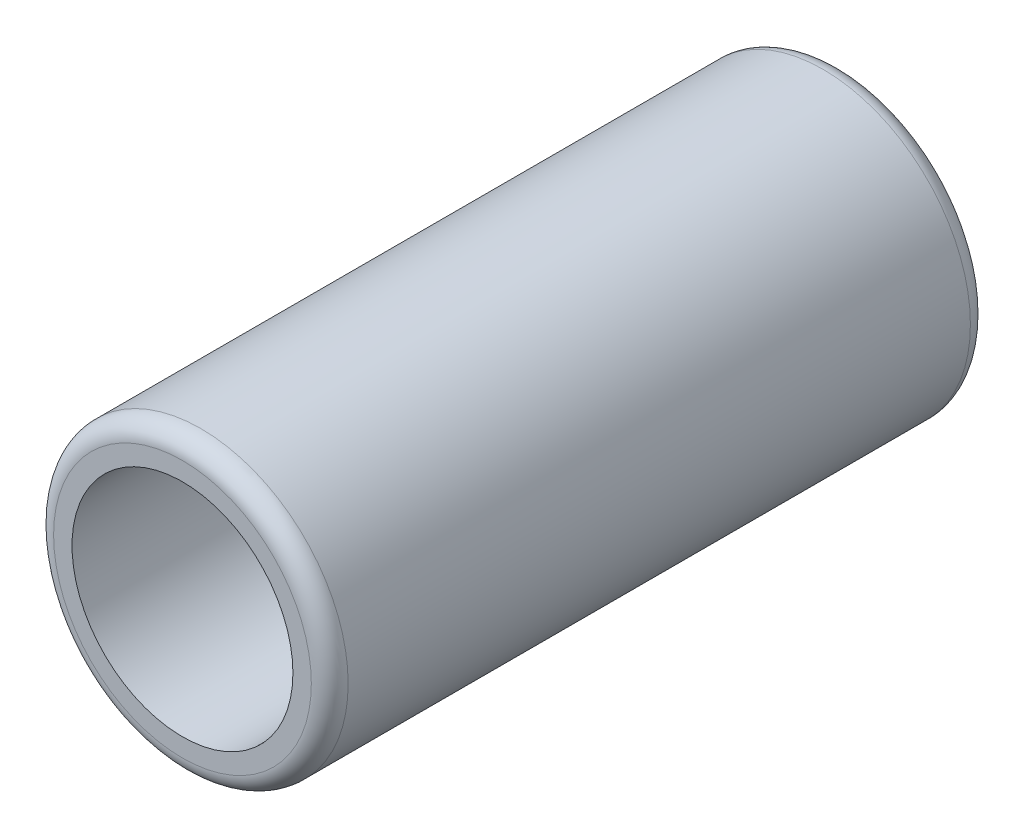
ISO-10303-21;
HEADER;
FILE_DESCRIPTION(('STEP AP214'),'2;1');
FILE_NAME('part.step','',(''),(''),'','','');
FILE_SCHEMA(('AUTOMOTIVE_DESIGN { 1 0 10303 214 1 1 1 1 }'));
ENDSEC;
DATA;
#1=APPLICATION_CONTEXT('core data for automotive mechanical design processes');
#2=APPLICATION_PROTOCOL_DEFINITION('international standard','automotive_design',2000,#1);
#3=PRODUCT_CONTEXT('',#1,'mechanical');
#4=PRODUCT('Part','Part','',(#3));
#5=PRODUCT_RELATED_PRODUCT_CATEGORY('part','',(#4));
#6=PRODUCT_DEFINITION_FORMATION('','',#4);
#7=PRODUCT_DEFINITION_CONTEXT('part definition',#1,'design');
#8=PRODUCT_DEFINITION('design','',#6,#7);
#9=PRODUCT_DEFINITION_SHAPE('','',#8);
#10=(LENGTH_UNIT() NAMED_UNIT(*) SI_UNIT(.MILLI.,.METRE.));
#11=(NAMED_UNIT(*) PLANE_ANGLE_UNIT() SI_UNIT($,.RADIAN.));
#12=(NAMED_UNIT(*) SI_UNIT($,.STERADIAN.) SOLID_ANGLE_UNIT());
#13=UNCERTAINTY_MEASURE_WITH_UNIT(LENGTH_MEASURE(1.E-05),#10,'distance_accuracy_value','');
#14=(GEOMETRIC_REPRESENTATION_CONTEXT(3) GLOBAL_UNCERTAINTY_ASSIGNED_CONTEXT((#13)) GLOBAL_UNIT_ASSIGNED_CONTEXT((#10,
#11,#12)) REPRESENTATION_CONTEXT('',''));
#15=CARTESIAN_POINT('',(0.,0.,0.));
#16=DIRECTION('',(0.,0.,1.));
#17=DIRECTION('',(1.,0.,0.));
#18=AXIS2_PLACEMENT_3D('',#15,#16,#17);
#19=CARTESIAN_POINT('',(0.,0.,17.9));
#20=DIRECTION('',(0.,0.,1.));
#21=DIRECTION('',(1.,0.,0.));
#22=AXIS2_PLACEMENT_3D('',#19,#20,#21);
#23=PLANE('',#22);
#24=CARTESIAN_POINT('',(0.,0.,17.9));
#25=DIRECTION('',(0.,0.,1.));
#26=DIRECTION('',(1.,0.,0.));
#27=AXIS2_PLACEMENT_3D('',#24,#25,#26);
#28=CIRCLE('',#27,3.5);
#29=CARTESIAN_POINT('',(3.5,0.,17.9));
#30=VERTEX_POINT('',#29);
#31=EDGE_CURVE('E10',#30,#30,#28,.T.);
#32=ORIENTED_EDGE('',*,*,#31,.T.);
#33=EDGE_LOOP('',(#32));
#34=FACE_BOUND('',#33,.T.);
#35=CARTESIAN_POINT('',(0.,0.,17.9));
#36=DIRECTION('',(0.,0.,1.));
#37=DIRECTION('',(1.,0.,0.));
#38=AXIS2_PLACEMENT_3D('',#35,#36,#37);
#39=CIRCLE('',#38,3.);
#40=CARTESIAN_POINT('',(3.,0.,17.9));
#41=VERTEX_POINT('',#40);
#42=EDGE_CURVE('E52',#41,#41,#39,.T.);
#43=ORIENTED_EDGE('',*,*,#42,.F.);
#44=EDGE_LOOP('',(#43));
#45=FACE_BOUND('',#44,.T.);
#46=ADVANCED_FACE('F32',(#34,#45),#23,.T.);
#47=CARTESIAN_POINT('',(0.,0.,0.));
#48=DIRECTION('',(0.,0.,1.));
#49=DIRECTION('',(1.,0.,0.));
#50=AXIS2_PLACEMENT_3D('',#47,#48,#49);
#51=PLANE('',#50);
#52=CARTESIAN_POINT('',(0.,0.,0.));
#53=DIRECTION('',(0.,0.,1.));
#54=DIRECTION('',(1.,0.,0.));
#55=AXIS2_PLACEMENT_3D('',#52,#53,#54);
#56=CIRCLE('',#55,3.5);
#57=CARTESIAN_POINT('',(3.5,0.,0.));
#58=VERTEX_POINT('',#57);
#59=EDGE_CURVE('E39',#58,#58,#56,.F.);
#60=ORIENTED_EDGE('',*,*,#59,.T.);
#61=EDGE_LOOP('',(#60));
#62=FACE_BOUND('',#61,.T.);
#63=CARTESIAN_POINT('',(0.,0.,0.));
#64=DIRECTION('',(0.,0.,1.));
#65=DIRECTION('',(1.,0.,0.));
#66=AXIS2_PLACEMENT_3D('',#63,#64,#65);
#67=CIRCLE('',#66,3.);
#68=CARTESIAN_POINT('',(3.,0.,0.));
#69=VERTEX_POINT('',#68);
#70=EDGE_CURVE('E53',#69,#69,#67,.T.);
#71=ORIENTED_EDGE('',*,*,#70,.T.);
#72=EDGE_LOOP('',(#71));
#73=FACE_BOUND('',#72,.T.);
#74=ADVANCED_FACE('F63',(#62,#73),#51,.F.);
#75=CARTESIAN_POINT('',(0.,0.,17.9));
#76=DIRECTION('',(0.,0.,-1.));
#77=DIRECTION('',(-1.,0.,0.));
#78=AXIS2_PLACEMENT_3D('',#75,#76,#77);
#79=CYLINDRICAL_SURFACE('',#78,4.);
#80=CARTESIAN_POINT('',(0.,0.,0.5));
#81=DIRECTION('',(0.,0.,1.));
#82=DIRECTION('',(1.,0.,0.));
#83=AXIS2_PLACEMENT_3D('',#80,#81,#82);
#84=CIRCLE('',#83,4.);
#85=CARTESIAN_POINT('',(4.,0.,0.5));
#86=VERTEX_POINT('',#85);
#87=EDGE_CURVE('E43',#86,#86,#84,.T.);
#88=ORIENTED_EDGE('',*,*,#87,.T.);
#89=EDGE_LOOP('',(#88));
#90=FACE_BOUND('',#89,.T.);
#91=CARTESIAN_POINT('',(0.,0.,17.4));
#92=DIRECTION('',(0.,0.,1.));
#93=DIRECTION('',(1.,0.,0.));
#94=AXIS2_PLACEMENT_3D('',#91,#92,#93);
#95=CIRCLE('',#94,4.);
#96=CARTESIAN_POINT('',(4.,0.,17.4));
#97=VERTEX_POINT('',#96);
#98=EDGE_CURVE('E47',#97,#97,#95,.F.);
#99=ORIENTED_EDGE('',*,*,#98,.T.);
#100=EDGE_LOOP('',(#99));
#101=FACE_BOUND('',#100,.T.);
#102=ADVANCED_FACE('F68',(#90,#101),#79,.T.);
#103=CARTESIAN_POINT('',(0.,0.,17.9));
#104=DIRECTION('',(0.,0.,-1.));
#105=DIRECTION('',(-1.,0.,0.));
#106=AXIS2_PLACEMENT_3D('',#103,#104,#105);
#107=CYLINDRICAL_SURFACE('',#106,3.);
#108=ORIENTED_EDGE('',*,*,#42,.T.);
#109=EDGE_LOOP('',(#108));
#110=FACE_BOUND('',#109,.T.);
#111=ORIENTED_EDGE('',*,*,#70,.F.);
#112=EDGE_LOOP('',(#111));
#113=FACE_BOUND('',#112,.T.);
#114=ADVANCED_FACE('F59',(#110,#113),#107,.F.);
#115=CARTESIAN_POINT('',(0.,0.,0.5));
#116=DIRECTION('',(0.,0.,1.));
#117=DIRECTION('',(1.,0.,0.));
#118=AXIS2_PLACEMENT_3D('',#115,#116,#117);
#119=TOROIDAL_SURFACE('',#118,3.5,0.5);
#120=ORIENTED_EDGE('',*,*,#59,.F.);
#121=EDGE_LOOP('',(#120));
#122=FACE_BOUND('',#121,.T.);
#123=ORIENTED_EDGE('',*,*,#87,.F.);
#124=EDGE_LOOP('',(#123));
#125=FACE_BOUND('',#124,.T.);
#126=ADVANCED_FACE('F74',(#122,#125),#119,.T.);
#127=CARTESIAN_POINT('',(0.,0.,17.4));
#128=DIRECTION('',(0.,0.,1.));
#129=DIRECTION('',(1.,0.,0.));
#130=AXIS2_PLACEMENT_3D('',#127,#128,#129);
#131=TOROIDAL_SURFACE('',#130,3.5,0.5);
#132=ORIENTED_EDGE('',*,*,#98,.F.);
#133=EDGE_LOOP('',(#132));
#134=FACE_BOUND('',#133,.T.);
#135=ORIENTED_EDGE('',*,*,#31,.F.);
#136=EDGE_LOOP('',(#135));
#137=FACE_BOUND('',#136,.T.);
#138=ADVANCED_FACE('F34',(#134,#137),#131,.T.);
#139=CLOSED_SHELL('',(#46,#74,#102,#114,#126,#138));
#140=MANIFOLD_SOLID_BREP('B2',#139);
#141=ADVANCED_BREP_SHAPE_REPRESENTATION('',(#18,#140),#14);
#142=SHAPE_DEFINITION_REPRESENTATION(#9,#141);
ENDSEC;
END-ISO-10303-21;
